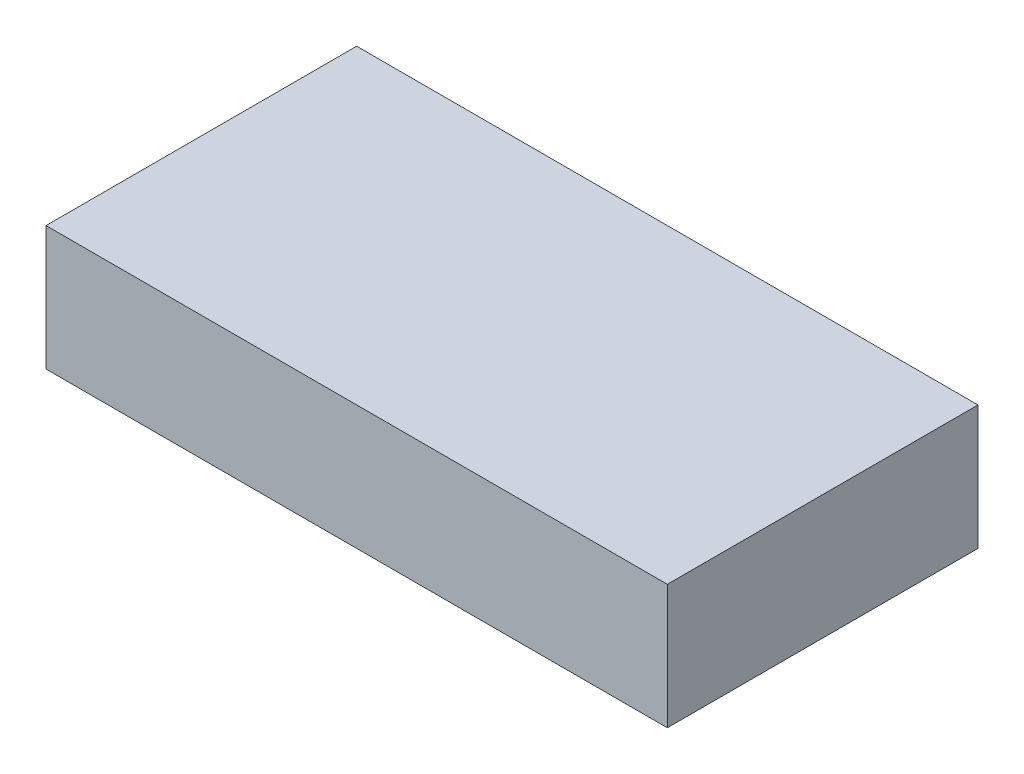
ISO-10303-21;
HEADER;
FILE_DESCRIPTION(('STEP AP214'),'2;1');
FILE_NAME('part.step','',(''),(''),'','','');
FILE_SCHEMA(('AUTOMOTIVE_DESIGN { 1 0 10303 214 1 1 1 1 }'));
ENDSEC;
DATA;
#1=APPLICATION_CONTEXT('core data for automotive mechanical design processes');
#2=APPLICATION_PROTOCOL_DEFINITION('international standard','automotive_design',2000,#1);
#3=PRODUCT_CONTEXT('',#1,'mechanical');
#4=PRODUCT('Part','Part','',(#3));
#5=PRODUCT_RELATED_PRODUCT_CATEGORY('part','',(#4));
#6=PRODUCT_DEFINITION_FORMATION('','',#4);
#7=PRODUCT_DEFINITION_CONTEXT('part definition',#1,'design');
#8=PRODUCT_DEFINITION('design','',#6,#7);
#9=PRODUCT_DEFINITION_SHAPE('','',#8);
#10=(LENGTH_UNIT() NAMED_UNIT(*) SI_UNIT(.MILLI.,.METRE.));
#11=(NAMED_UNIT(*) PLANE_ANGLE_UNIT() SI_UNIT($,.RADIAN.));
#12=(NAMED_UNIT(*) SI_UNIT($,.STERADIAN.) SOLID_ANGLE_UNIT());
#13=UNCERTAINTY_MEASURE_WITH_UNIT(LENGTH_MEASURE(1.E-05),#10,'distance_accuracy_value','');
#14=(GEOMETRIC_REPRESENTATION_CONTEXT(3) GLOBAL_UNCERTAINTY_ASSIGNED_CONTEXT((#13)) GLOBAL_UNIT_ASSIGNED_CONTEXT((#10,
#11,#12)) REPRESENTATION_CONTEXT('',''));
#15=CARTESIAN_POINT('',(0.,0.,0.));
#16=DIRECTION('',(0.,0.,1.));
#17=DIRECTION('',(1.,0.,0.));
#18=AXIS2_PLACEMENT_3D('',#15,#16,#17);
#19=CARTESIAN_POINT('',(-10.,2.,10.));
#20=DIRECTION('',(1.,0.,0.));
#21=DIRECTION('',(0.,0.,-1.));
#22=AXIS2_PLACEMENT_3D('',#19,#20,#21);
#23=PLANE('',#22);
#24=DIRECTION('',(0.,-1.,0.));
#25=VECTOR('',#24,1.);
#26=CARTESIAN_POINT('',(-10.,2.,0.));
#27=LINE('',#26,#25);
#28=CARTESIAN_POINT('',(-10.,2.,0.));
#29=VERTEX_POINT('',#28);
#30=CARTESIAN_POINT('',(-10.,-2.,0.));
#31=VERTEX_POINT('',#30);
#32=EDGE_CURVE('E111',#29,#31,#27,.T.);
#33=ORIENTED_EDGE('',*,*,#32,.T.);
#34=DIRECTION('',(0.,0.,-1.));
#35=VECTOR('',#34,1.);
#36=CARTESIAN_POINT('',(-10.,-2.,10.));
#37=LINE('',#36,#35);
#38=CARTESIAN_POINT('',(-10.,-2.,10.));
#39=VERTEX_POINT('',#38);
#40=EDGE_CURVE('E101',#39,#31,#37,.T.);
#41=ORIENTED_EDGE('',*,*,#40,.F.);
#42=DIRECTION('',(0.,-1.,0.));
#43=VECTOR('',#42,1.);
#44=CARTESIAN_POINT('',(-10.,2.,10.));
#45=LINE('',#44,#43);
#46=CARTESIAN_POINT('',(-10.,2.,10.));
#47=VERTEX_POINT('',#46);
#48=EDGE_CURVE('E90',#47,#39,#45,.T.);
#49=ORIENTED_EDGE('',*,*,#48,.F.);
#50=DIRECTION('',(0.,0.,-1.));
#51=VECTOR('',#50,1.);
#52=CARTESIAN_POINT('',(-10.,2.,10.));
#53=LINE('',#52,#51);
#54=EDGE_CURVE('E56',#47,#29,#53,.T.);
#55=ORIENTED_EDGE('',*,*,#54,.T.);
#56=EDGE_LOOP('',(#33,#41,#49,#55));
#57=FACE_BOUND('',#56,.T.);
#58=ADVANCED_FACE('F39',(#57),#23,.F.);
#59=CARTESIAN_POINT('',(-10.,-2.,10.));
#60=DIRECTION('',(0.,1.,0.));
#61=DIRECTION('',(0.,0.,1.));
#62=AXIS2_PLACEMENT_3D('',#59,#60,#61);
#63=PLANE('',#62);
#64=CARTESIAN_POINT('',(9.25,-2.,9.25));
#65=DIRECTION('',(0.,1.,0.));
#66=DIRECTION('',(0.,0.,1.));
#67=AXIS2_PLACEMENT_3D('',#64,#65,#66);
#68=CIRCLE('',#67,0.25);
#69=CARTESIAN_POINT('',(9.25,-2.,9.5));
#70=VERTEX_POINT('',#69);
#71=EDGE_CURVE('E11',#70,#70,#68,.F.);
#72=ORIENTED_EDGE('',*,*,#71,.F.);
#73=EDGE_LOOP('',(#72));
#74=FACE_BOUND('',#73,.T.);
#75=CARTESIAN_POINT('',(8.25,-2.,9.25));
#76=DIRECTION('',(0.,1.,0.));
#77=DIRECTION('',(0.,0.,1.));
#78=AXIS2_PLACEMENT_3D('',#75,#76,#77);
#79=CIRCLE('',#78,0.25);
#80=CARTESIAN_POINT('',(8.25,-2.,9.5));
#81=VERTEX_POINT('',#80);
#82=EDGE_CURVE('E48',#81,#81,#79,.F.);
#83=ORIENTED_EDGE('',*,*,#82,.F.);
#84=EDGE_LOOP('',(#83));
#85=FACE_BOUND('',#84,.T.);
#86=CARTESIAN_POINT('',(7.25,-2.,9.25));
#87=DIRECTION('',(0.,1.,0.));
#88=DIRECTION('',(0.,0.,1.));
#89=AXIS2_PLACEMENT_3D('',#86,#87,#88);
#90=CIRCLE('',#89,0.25);
#91=CARTESIAN_POINT('',(7.25,-2.,9.5));
#92=VERTEX_POINT('',#91);
#93=EDGE_CURVE('E131',#92,#92,#90,.F.);
#94=ORIENTED_EDGE('',*,*,#93,.F.);
#95=EDGE_LOOP('',(#94));
#96=FACE_BOUND('',#95,.T.);
#97=CARTESIAN_POINT('',(0.,-2.,5.));
#98=DIRECTION('',(0.,-1.,0.));
#99=DIRECTION('',(0.,0.,-1.));
#100=AXIS2_PLACEMENT_3D('',#97,#98,#99);
#101=CIRCLE('',#100,4.);
#102=CARTESIAN_POINT('',(0.,-2.,1.));
#103=VERTEX_POINT('',#102);
#104=EDGE_CURVE('E130',#103,#103,#101,.T.);
#105=ORIENTED_EDGE('',*,*,#104,.F.);
#106=EDGE_LOOP('',(#105));
#107=FACE_BOUND('',#106,.T.);
#108=DIRECTION('',(1.,0.,0.));
#109=VECTOR('',#108,1.);
#110=CARTESIAN_POINT('',(-10.,-2.,0.));
#111=LINE('',#110,#109);
#112=CARTESIAN_POINT('',(10.,-2.,0.));
#113=VERTEX_POINT('',#112);
#114=EDGE_CURVE('E97',#31,#113,#111,.T.);
#115=ORIENTED_EDGE('',*,*,#114,.T.);
#116=DIRECTION('',(0.,0.,-1.));
#117=VECTOR('',#116,1.);
#118=CARTESIAN_POINT('',(10.,-2.,10.));
#119=LINE('',#118,#117);
#120=CARTESIAN_POINT('',(10.,-2.,10.));
#121=VERTEX_POINT('',#120);
#122=EDGE_CURVE('E95',#121,#113,#119,.T.);
#123=ORIENTED_EDGE('',*,*,#122,.F.);
#124=DIRECTION('',(1.,0.,0.));
#125=VECTOR('',#124,1.);
#126=CARTESIAN_POINT('',(-10.,-2.,10.));
#127=LINE('',#126,#125);
#128=EDGE_CURVE('E82',#39,#121,#127,.T.);
#129=ORIENTED_EDGE('',*,*,#128,.F.);
#130=ORIENTED_EDGE('',*,*,#40,.T.);
#131=EDGE_LOOP('',(#115,#123,#129,#130));
#132=FACE_BOUND('',#131,.T.);
#133=ADVANCED_FACE('F96',(#74,#85,#96,#107,#132),#63,.F.);
#134=CARTESIAN_POINT('',(10.,2.,10.));
#135=DIRECTION('',(1.,0.,0.));
#136=DIRECTION('',(0.,0.,-1.));
#137=AXIS2_PLACEMENT_3D('',#134,#135,#136);
#138=PLANE('',#137);
#139=DIRECTION('',(0.,-1.,0.));
#140=VECTOR('',#139,1.);
#141=CARTESIAN_POINT('',(10.,2.,0.));
#142=LINE('',#141,#140);
#143=CARTESIAN_POINT('',(10.,2.,0.));
#144=VERTEX_POINT('',#143);
#145=EDGE_CURVE('E117',#144,#113,#142,.T.);
#146=ORIENTED_EDGE('',*,*,#145,.F.);
#147=DIRECTION('',(0.,0.,-1.));
#148=VECTOR('',#147,1.);
#149=CARTESIAN_POINT('',(10.,2.,10.));
#150=LINE('',#149,#148);
#151=CARTESIAN_POINT('',(10.,2.,10.));
#152=VERTEX_POINT('',#151);
#153=EDGE_CURVE('E70',#152,#144,#150,.T.);
#154=ORIENTED_EDGE('',*,*,#153,.F.);
#155=DIRECTION('',(0.,-1.,0.));
#156=VECTOR('',#155,1.);
#157=CARTESIAN_POINT('',(10.,2.,10.));
#158=LINE('',#157,#156);
#159=EDGE_CURVE('E89',#152,#121,#158,.T.);
#160=ORIENTED_EDGE('',*,*,#159,.T.);
#161=ORIENTED_EDGE('',*,*,#122,.T.);
#162=EDGE_LOOP('',(#146,#154,#160,#161));
#163=FACE_BOUND('',#162,.T.);
#164=ADVANCED_FACE('F103',(#163),#138,.T.);
#165=CARTESIAN_POINT('',(-10.,2.,10.));
#166=DIRECTION('',(0.,1.,0.));
#167=DIRECTION('',(0.,0.,1.));
#168=AXIS2_PLACEMENT_3D('',#165,#166,#167);
#169=PLANE('',#168);
#170=DIRECTION('',(1.,0.,0.));
#171=VECTOR('',#170,1.);
#172=CARTESIAN_POINT('',(-10.,2.,0.));
#173=LINE('',#172,#171);
#174=EDGE_CURVE('E120',#29,#144,#173,.T.);
#175=ORIENTED_EDGE('',*,*,#174,.F.);
#176=ORIENTED_EDGE('',*,*,#54,.F.);
#177=DIRECTION('',(1.,0.,0.));
#178=VECTOR('',#177,1.);
#179=CARTESIAN_POINT('',(-10.,2.,10.));
#180=LINE('',#179,#178);
#181=EDGE_CURVE('E105',#47,#152,#180,.T.);
#182=ORIENTED_EDGE('',*,*,#181,.T.);
#183=ORIENTED_EDGE('',*,*,#153,.T.);
#184=EDGE_LOOP('',(#175,#176,#182,#183));
#185=FACE_BOUND('',#184,.T.);
#186=ADVANCED_FACE('F196',(#185),#169,.T.);
#187=CARTESIAN_POINT('',(0.,0.,10.));
#188=DIRECTION('',(0.,0.,1.));
#189=DIRECTION('',(1.,0.,0.));
#190=AXIS2_PLACEMENT_3D('',#187,#188,#189);
#191=PLANE('',#190);
#192=ORIENTED_EDGE('',*,*,#48,.T.);
#193=ORIENTED_EDGE('',*,*,#128,.T.);
#194=ORIENTED_EDGE('',*,*,#159,.F.);
#195=ORIENTED_EDGE('',*,*,#181,.F.);
#196=EDGE_LOOP('',(#192,#193,#194,#195));
#197=FACE_BOUND('',#196,.T.);
#198=ADVANCED_FACE('F86',(#197),#191,.T.);
#199=CARTESIAN_POINT('',(0.,0.,0.));
#200=DIRECTION('',(0.,0.,1.));
#201=DIRECTION('',(1.,0.,0.));
#202=AXIS2_PLACEMENT_3D('',#199,#200,#201);
#203=PLANE('',#202);
#204=ORIENTED_EDGE('',*,*,#32,.F.);
#205=ORIENTED_EDGE('',*,*,#174,.T.);
#206=ORIENTED_EDGE('',*,*,#145,.T.);
#207=ORIENTED_EDGE('',*,*,#114,.F.);
#208=EDGE_LOOP('',(#204,#205,#206,#207));
#209=FACE_BOUND('',#208,.T.);
#210=ADVANCED_FACE('F195',(#209),#203,.F.);
#211=CARTESIAN_POINT('',(0.,-3.,5.));
#212=DIRECTION('',(0.,1.,0.));
#213=DIRECTION('',(0.,0.,1.));
#214=AXIS2_PLACEMENT_3D('',#211,#212,#213);
#215=CYLINDRICAL_SURFACE('',#214,4.);
#216=CARTESIAN_POINT('',(0.,-3.,5.));
#217=DIRECTION('',(0.,-1.,0.));
#218=DIRECTION('',(0.,0.,-1.));
#219=AXIS2_PLACEMENT_3D('',#216,#217,#218);
#220=CIRCLE('',#219,4.);
#221=CARTESIAN_POINT('',(0.,-3.,1.));
#222=VERTEX_POINT('',#221);
#223=EDGE_CURVE('E114',#222,#222,#220,.T.);
#224=ORIENTED_EDGE('',*,*,#223,.F.);
#225=EDGE_LOOP('',(#224));
#226=FACE_BOUND('',#225,.T.);
#227=ORIENTED_EDGE('',*,*,#104,.T.);
#228=EDGE_LOOP('',(#227));
#229=FACE_BOUND('',#228,.T.);
#230=ADVANCED_FACE('F207',(#226,#229),#215,.T.);
#231=CARTESIAN_POINT('',(0.,-3.,5.));
#232=DIRECTION('',(0.,-1.,0.));
#233=DIRECTION('',(0.,0.,-1.));
#234=AXIS2_PLACEMENT_3D('',#231,#232,#233);
#235=PLANE('',#234);
#236=CARTESIAN_POINT('',(0.,-3.,5.));
#237=DIRECTION('',(0.,-1.,0.));
#238=DIRECTION('',(0.,0.,-1.));
#239=AXIS2_PLACEMENT_3D('',#236,#237,#238);
#240=CIRCLE('',#239,3.5);
#241=CARTESIAN_POINT('',(0.,-3.,1.5));
#242=VERTEX_POINT('',#241);
#243=EDGE_CURVE('E159',#242,#242,#240,.T.);
#244=ORIENTED_EDGE('',*,*,#243,.F.);
#245=EDGE_LOOP('',(#244));
#246=FACE_BOUND('',#245,.T.);
#247=ORIENTED_EDGE('',*,*,#223,.T.);
#248=EDGE_LOOP('',(#247));
#249=FACE_BOUND('',#248,.T.);
#250=ADVANCED_FACE('F211',(#246,#249),#235,.T.);
#251=CARTESIAN_POINT('',(0.,-2.75,5.));
#252=DIRECTION('',(0.,-1.,0.));
#253=DIRECTION('',(0.,0.,-1.));
#254=AXIS2_PLACEMENT_3D('',#251,#252,#253);
#255=CYLINDRICAL_SURFACE('',#254,3.5);
#256=CARTESIAN_POINT('',(0.,-2.75,5.));
#257=DIRECTION('',(0.,-1.,0.));
#258=DIRECTION('',(0.,0.,-1.));
#259=AXIS2_PLACEMENT_3D('',#256,#257,#258);
#260=CIRCLE('',#259,3.5);
#261=CARTESIAN_POINT('',(0.,-2.75,1.5));
#262=VERTEX_POINT('',#261);
#263=EDGE_CURVE('E156',#262,#262,#260,.T.);
#264=ORIENTED_EDGE('',*,*,#263,.F.);
#265=EDGE_LOOP('',(#264));
#266=FACE_BOUND('',#265,.T.);
#267=ORIENTED_EDGE('',*,*,#243,.T.);
#268=EDGE_LOOP('',(#267));
#269=FACE_BOUND('',#268,.T.);
#270=ADVANCED_FACE('F215',(#266,#269),#255,.F.);
#271=CARTESIAN_POINT('',(0.,-2.75,5.));
#272=DIRECTION('',(0.,-1.,0.));
#273=DIRECTION('',(0.,0.,-1.));
#274=AXIS2_PLACEMENT_3D('',#271,#272,#273);
#275=PLANE('',#274);
#276=ORIENTED_EDGE('',*,*,#263,.T.);
#277=EDGE_LOOP('',(#276));
#278=FACE_BOUND('',#277,.T.);
#279=ADVANCED_FACE('F219',(#278),#275,.T.);
#280=CARTESIAN_POINT('',(7.25,-2.25,9.25));
#281=DIRECTION('',(0.,1.,0.));
#282=DIRECTION('',(0.,0.,1.));
#283=AXIS2_PLACEMENT_3D('',#280,#281,#282);
#284=CYLINDRICAL_SURFACE('',#283,0.25);
#285=CARTESIAN_POINT('',(7.25,-2.25,9.25));
#286=DIRECTION('',(0.,-1.,0.));
#287=DIRECTION('',(0.,0.,-1.));
#288=AXIS2_PLACEMENT_3D('',#285,#286,#287);
#289=CIRCLE('',#288,0.25);
#290=CARTESIAN_POINT('',(7.25,-2.25,9.));
#291=VERTEX_POINT('',#290);
#292=EDGE_CURVE('E163',#291,#291,#289,.T.);
#293=ORIENTED_EDGE('',*,*,#292,.F.);
#294=EDGE_LOOP('',(#293));
#295=FACE_BOUND('',#294,.T.);
#296=ORIENTED_EDGE('',*,*,#93,.T.);
#297=EDGE_LOOP('',(#296));
#298=FACE_BOUND('',#297,.T.);
#299=ADVANCED_FACE('F223',(#295,#298),#284,.T.);
#300=CARTESIAN_POINT('',(7.25,-2.25,9.25));
#301=DIRECTION('',(0.,-1.,0.));
#302=DIRECTION('',(0.,0.,-1.));
#303=AXIS2_PLACEMENT_3D('',#300,#301,#302);
#304=PLANE('',#303);
#305=ORIENTED_EDGE('',*,*,#292,.T.);
#306=EDGE_LOOP('',(#305));
#307=FACE_BOUND('',#306,.T.);
#308=ADVANCED_FACE('F227',(#307),#304,.T.);
#309=CARTESIAN_POINT('',(8.25,-2.25,9.25));
#310=DIRECTION('',(0.,1.,0.));
#311=DIRECTION('',(0.,0.,1.));
#312=AXIS2_PLACEMENT_3D('',#309,#310,#311);
#313=CYLINDRICAL_SURFACE('',#312,0.25);
#314=CARTESIAN_POINT('',(8.25,-2.25,9.25));
#315=DIRECTION('',(0.,-1.,0.));
#316=DIRECTION('',(0.,0.,-1.));
#317=AXIS2_PLACEMENT_3D('',#314,#315,#316);
#318=CIRCLE('',#317,0.25);
#319=CARTESIAN_POINT('',(8.25,-2.25,9.));
#320=VERTEX_POINT('',#319);
#321=EDGE_CURVE('E166',#320,#320,#318,.T.);
#322=ORIENTED_EDGE('',*,*,#321,.F.);
#323=EDGE_LOOP('',(#322));
#324=FACE_BOUND('',#323,.T.);
#325=ORIENTED_EDGE('',*,*,#82,.T.);
#326=EDGE_LOOP('',(#325));
#327=FACE_BOUND('',#326,.T.);
#328=ADVANCED_FACE('F138',(#324,#327),#313,.T.);
#329=CARTESIAN_POINT('',(8.25,-2.25,9.25));
#330=DIRECTION('',(0.,-1.,0.));
#331=DIRECTION('',(0.,0.,-1.));
#332=AXIS2_PLACEMENT_3D('',#329,#330,#331);
#333=PLANE('',#332);
#334=ORIENTED_EDGE('',*,*,#321,.T.);
#335=EDGE_LOOP('',(#334));
#336=FACE_BOUND('',#335,.T.);
#337=ADVANCED_FACE('F181',(#336),#333,.T.);
#338=CARTESIAN_POINT('',(9.25,-2.25,9.25));
#339=DIRECTION('',(0.,1.,0.));
#340=DIRECTION('',(0.,0.,1.));
#341=AXIS2_PLACEMENT_3D('',#338,#339,#340);
#342=CYLINDRICAL_SURFACE('',#341,0.25);
#343=CARTESIAN_POINT('',(9.25,-2.25,9.25));
#344=DIRECTION('',(0.,-1.,0.));
#345=DIRECTION('',(0.,0.,-1.));
#346=AXIS2_PLACEMENT_3D('',#343,#344,#345);
#347=CIRCLE('',#346,0.25);
#348=CARTESIAN_POINT('',(9.25,-2.25,9.));
#349=VERTEX_POINT('',#348);
#350=EDGE_CURVE('E170',#349,#349,#347,.T.);
#351=ORIENTED_EDGE('',*,*,#350,.F.);
#352=EDGE_LOOP('',(#351));
#353=FACE_BOUND('',#352,.T.);
#354=ORIENTED_EDGE('',*,*,#71,.T.);
#355=EDGE_LOOP('',(#354));
#356=FACE_BOUND('',#355,.T.);
#357=ADVANCED_FACE('F178',(#353,#356),#342,.T.);
#358=CARTESIAN_POINT('',(9.25,-2.25,9.25));
#359=DIRECTION('',(0.,-1.,0.));
#360=DIRECTION('',(0.,0.,-1.));
#361=AXIS2_PLACEMENT_3D('',#358,#359,#360);
#362=PLANE('',#361);
#363=ORIENTED_EDGE('',*,*,#350,.T.);
#364=EDGE_LOOP('',(#363));
#365=FACE_BOUND('',#364,.T.);
#366=ADVANCED_FACE('F176',(#365),#362,.T.);
#367=CLOSED_SHELL('',(#58,#133,#164,#186,#198,#210,#230,#250,#270,#279,#299,#308,#328,#337,#357,#366));
#368=MANIFOLD_SOLID_BREP('B2',#367);
#369=ADVANCED_BREP_SHAPE_REPRESENTATION('',(#18,#368),#14);
#370=SHAPE_DEFINITION_REPRESENTATION(#9,#369);
ENDSEC;
END-ISO-10303-21;
